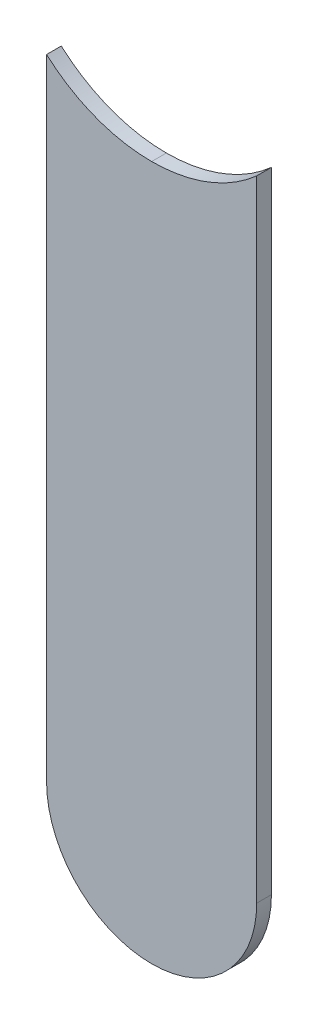
ISO-10303-21;
HEADER;
FILE_DESCRIPTION(('STEP AP214'),'2;1');
FILE_NAME('part.step','',(''),(''),'','','');
FILE_SCHEMA(('AUTOMOTIVE_DESIGN { 1 0 10303 214 1 1 1 1 }'));
ENDSEC;
DATA;
#1=APPLICATION_CONTEXT('core data for automotive mechanical design processes');
#2=APPLICATION_PROTOCOL_DEFINITION('international standard','automotive_design',2000,#1);
#3=PRODUCT_CONTEXT('',#1,'mechanical');
#4=PRODUCT('Part','Part','',(#3));
#5=PRODUCT_RELATED_PRODUCT_CATEGORY('part','',(#4));
#6=PRODUCT_DEFINITION_FORMATION('','',#4);
#7=PRODUCT_DEFINITION_CONTEXT('part definition',#1,'design');
#8=PRODUCT_DEFINITION('design','',#6,#7);
#9=PRODUCT_DEFINITION_SHAPE('','',#8);
#10=(LENGTH_UNIT() NAMED_UNIT(*) SI_UNIT(.MILLI.,.METRE.));
#11=(NAMED_UNIT(*) PLANE_ANGLE_UNIT() SI_UNIT($,.RADIAN.));
#12=(NAMED_UNIT(*) SI_UNIT($,.STERADIAN.) SOLID_ANGLE_UNIT());
#13=UNCERTAINTY_MEASURE_WITH_UNIT(LENGTH_MEASURE(1.E-05),#10,'distance_accuracy_value','');
#14=(GEOMETRIC_REPRESENTATION_CONTEXT(3) GLOBAL_UNCERTAINTY_ASSIGNED_CONTEXT((#13)) GLOBAL_UNIT_ASSIGNED_CONTEXT((#10,
#11,#12)) REPRESENTATION_CONTEXT('',''));
#15=CARTESIAN_POINT('',(0.,0.,0.));
#16=DIRECTION('',(0.,0.,1.));
#17=DIRECTION('',(1.,0.,0.));
#18=AXIS2_PLACEMENT_3D('',#15,#16,#17);
#19=CARTESIAN_POINT('',(142.24,-103.632,-0.045));
#20=DIRECTION('',(0.,0.,-1.));
#21=DIRECTION('',(0.,-1.,0.));
#22=AXIS2_PLACEMENT_3D('',#19,#20,#21);
#23=CYLINDRICAL_SURFACE('',#22,0.375);
#24=DIRECTION('',(0.,0.,1.));
#25=VECTOR('',#24,1.);
#26=CARTESIAN_POINT('',(142.24,-104.007,-0.045));
#27=LINE('',#26,#25);
#28=CARTESIAN_POINT('',(142.24,-104.007,-0.035));
#29=VERTEX_POINT('',#28);
#30=CARTESIAN_POINT('',(142.24,-104.007,0.));
#31=VERTEX_POINT('',#30);
#32=EDGE_CURVE('E50',#29,#31,#27,.T.);
#33=ORIENTED_EDGE('',*,*,#32,.F.);
#34=CARTESIAN_POINT('',(142.24,-103.632,-0.035));
#35=DIRECTION('',(0.,0.,-1.));
#36=DIRECTION('',(0.,-1.,0.));
#37=AXIS2_PLACEMENT_3D('',#34,#35,#36);
#38=CIRCLE('',#37,0.375);
#39=CARTESIAN_POINT('',(141.99,-103.9115084972,-0.035));
#40=VERTEX_POINT('',#39);
#41=EDGE_CURVE('E118',#29,#40,#38,.T.);
#42=ORIENTED_EDGE('',*,*,#41,.T.);
#43=DIRECTION('',(0.,0.,-1.));
#44=VECTOR('',#43,1.);
#45=CARTESIAN_POINT('',(141.99,-103.9115084971,-0.045));
#46=LINE('',#45,#44);
#47=CARTESIAN_POINT('',(141.99,-103.9115084972,0.));
#48=VERTEX_POINT('',#47);
#49=EDGE_CURVE('E11',#48,#40,#46,.T.);
#50=ORIENTED_EDGE('',*,*,#49,.F.);
#51=CARTESIAN_POINT('',(142.24,-103.632,0.));
#52=DIRECTION('',(0.,0.,-1.));
#53=DIRECTION('',(0.,-1.,0.));
#54=AXIS2_PLACEMENT_3D('',#51,#52,#53);
#55=CIRCLE('',#54,0.375);
#56=EDGE_CURVE('E126',#31,#48,#55,.T.);
#57=ORIENTED_EDGE('',*,*,#56,.F.);
#58=EDGE_LOOP('',(#33,#42,#50,#57));
#59=FACE_BOUND('',#58,.T.);
#60=ADVANCED_FACE('F17',(#59),#23,.F.);
#61=CARTESIAN_POINT('',(141.99,-103.632,-0.035));
#62=DIRECTION('',(1.,0.,0.));
#63=DIRECTION('',(0.,1.,0.));
#64=AXIS2_PLACEMENT_3D('',#61,#62,#63);
#65=PLANE('',#64);
#66=DIRECTION('',(0.,0.,1.));
#67=VECTOR('',#66,1.);
#68=CARTESIAN_POINT('',(141.99,-105.41,-0.035));
#69=LINE('',#68,#67);
#70=CARTESIAN_POINT('',(141.99,-105.41,-0.035));
#71=VERTEX_POINT('',#70);
#72=CARTESIAN_POINT('',(141.99,-105.41,0.));
#73=VERTEX_POINT('',#72);
#74=EDGE_CURVE('E20',#71,#73,#69,.T.);
#75=ORIENTED_EDGE('',*,*,#74,.T.);
#76=DIRECTION('',(0.,-1.,0.));
#77=VECTOR('',#76,1.);
#78=CARTESIAN_POINT('',(141.99,-103.632,0.));
#79=LINE('',#78,#77);
#80=EDGE_CURVE('E127',#48,#73,#79,.T.);
#81=ORIENTED_EDGE('',*,*,#80,.F.);
#82=ORIENTED_EDGE('',*,*,#49,.T.);
#83=DIRECTION('',(0.,-1.,0.));
#84=VECTOR('',#83,1.);
#85=CARTESIAN_POINT('',(141.99,-103.632,-0.035));
#86=LINE('',#85,#84);
#87=EDGE_CURVE('E98',#40,#71,#86,.T.);
#88=ORIENTED_EDGE('',*,*,#87,.T.);
#89=EDGE_LOOP('',(#75,#81,#82,#88));
#90=FACE_BOUND('',#89,.T.);
#91=ADVANCED_FACE('F148',(#90),#65,.F.);
#92=CARTESIAN_POINT('',(142.24,-105.41,-0.035));
#93=DIRECTION('',(0.,0.,-1.));
#94=DIRECTION('',(-1.,0.,0.));
#95=AXIS2_PLACEMENT_3D('',#92,#93,#94);
#96=CYLINDRICAL_SURFACE('',#95,0.25);
#97=CARTESIAN_POINT('',(142.24,-105.41,-0.035));
#98=DIRECTION('',(0.,0.,1.));
#99=DIRECTION('',(-1.,0.,0.));
#100=AXIS2_PLACEMENT_3D('',#97,#98,#99);
#101=CIRCLE('',#100,0.25);
#102=CARTESIAN_POINT('',(142.49,-105.41,-0.035));
#103=VERTEX_POINT('',#102);
#104=EDGE_CURVE('E78',#71,#103,#101,.T.);
#105=ORIENTED_EDGE('',*,*,#104,.T.);
#106=DIRECTION('',(0.,0.,1.));
#107=VECTOR('',#106,1.);
#108=CARTESIAN_POINT('',(142.49,-105.41,-0.035));
#109=LINE('',#108,#107);
#110=CARTESIAN_POINT('',(142.49,-105.41,0.));
#111=VERTEX_POINT('',#110);
#112=EDGE_CURVE('E82',#103,#111,#109,.T.);
#113=ORIENTED_EDGE('',*,*,#112,.T.);
#114=CARTESIAN_POINT('',(142.24,-105.41,0.));
#115=DIRECTION('',(0.,0.,1.));
#116=DIRECTION('',(-1.,0.,0.));
#117=AXIS2_PLACEMENT_3D('',#114,#115,#116);
#118=CIRCLE('',#117,0.25);
#119=EDGE_CURVE('E123',#73,#111,#118,.T.);
#120=ORIENTED_EDGE('',*,*,#119,.F.);
#121=ORIENTED_EDGE('',*,*,#74,.F.);
#122=EDGE_LOOP('',(#105,#113,#120,#121));
#123=FACE_BOUND('',#122,.T.);
#124=ADVANCED_FACE('F80',(#123),#96,.T.);
#125=CARTESIAN_POINT('',(142.49,-105.41,0.));
#126=DIRECTION('',(0.,0.,1.));
#127=DIRECTION('',(1.,0.,0.));
#128=AXIS2_PLACEMENT_3D('',#125,#126,#127);
#129=PLANE('',#128);
#130=ORIENTED_EDGE('',*,*,#119,.T.);
#131=DIRECTION('',(0.,1.,0.));
#132=VECTOR('',#131,1.);
#133=CARTESIAN_POINT('',(142.49,-105.41,0.));
#134=LINE('',#133,#132);
#135=CARTESIAN_POINT('',(142.49,-103.9115084971,0.));
#136=VERTEX_POINT('',#135);
#137=EDGE_CURVE('E102',#111,#136,#134,.T.);
#138=ORIENTED_EDGE('',*,*,#137,.T.);
#139=CARTESIAN_POINT('',(142.24,-103.632,0.));
#140=DIRECTION('',(0.,0.,-1.));
#141=DIRECTION('',(0.,-1.,0.));
#142=AXIS2_PLACEMENT_3D('',#139,#140,#141);
#143=CIRCLE('',#142,0.375);
#144=EDGE_CURVE('E114',#136,#31,#143,.T.);
#145=ORIENTED_EDGE('',*,*,#144,.T.);
#146=ORIENTED_EDGE('',*,*,#56,.T.);
#147=ORIENTED_EDGE('',*,*,#80,.T.);
#148=EDGE_LOOP('',(#130,#138,#145,#146,#147));
#149=FACE_BOUND('',#148,.T.);
#150=ADVANCED_FACE('F144',(#149),#129,.T.);
#151=CARTESIAN_POINT('',(142.24,-103.632,-0.045));
#152=DIRECTION('',(0.,0.,-1.));
#153=DIRECTION('',(0.,-1.,0.));
#154=AXIS2_PLACEMENT_3D('',#151,#152,#153);
#155=CYLINDRICAL_SURFACE('',#154,0.375);
#156=CARTESIAN_POINT('',(142.24,-103.632,-0.035));
#157=DIRECTION('',(0.,0.,-1.));
#158=DIRECTION('',(0.,-1.,0.));
#159=AXIS2_PLACEMENT_3D('',#156,#157,#158);
#160=CIRCLE('',#159,0.375);
#161=CARTESIAN_POINT('',(142.49,-103.9115084971,-0.035));
#162=VERTEX_POINT('',#161);
#163=EDGE_CURVE('E88',#162,#29,#160,.T.);
#164=ORIENTED_EDGE('',*,*,#163,.T.);
#165=ORIENTED_EDGE('',*,*,#32,.T.);
#166=ORIENTED_EDGE('',*,*,#144,.F.);
#167=DIRECTION('',(0.,0.,-1.));
#168=VECTOR('',#167,1.);
#169=CARTESIAN_POINT('',(142.49,-103.9115084971,-0.045));
#170=LINE('',#169,#168);
#171=EDGE_CURVE('E109',#136,#162,#170,.T.);
#172=ORIENTED_EDGE('',*,*,#171,.T.);
#173=EDGE_LOOP('',(#164,#165,#166,#172));
#174=FACE_BOUND('',#173,.T.);
#175=ADVANCED_FACE('F146',(#174),#155,.F.);
#176=CARTESIAN_POINT('',(142.49,-105.41,-0.035));
#177=DIRECTION('',(0.,0.,1.));
#178=DIRECTION('',(1.,0.,0.));
#179=AXIS2_PLACEMENT_3D('',#176,#177,#178);
#180=PLANE('',#179);
#181=ORIENTED_EDGE('',*,*,#87,.F.);
#182=ORIENTED_EDGE('',*,*,#41,.F.);
#183=ORIENTED_EDGE('',*,*,#163,.F.);
#184=DIRECTION('',(0.,1.,0.));
#185=VECTOR('',#184,1.);
#186=CARTESIAN_POINT('',(142.49,-105.41,-0.035));
#187=LINE('',#186,#185);
#188=EDGE_CURVE('E91',#103,#162,#187,.T.);
#189=ORIENTED_EDGE('',*,*,#188,.F.);
#190=ORIENTED_EDGE('',*,*,#104,.F.);
#191=EDGE_LOOP('',(#181,#182,#183,#189,#190));
#192=FACE_BOUND('',#191,.T.);
#193=ADVANCED_FACE('F92',(#192),#180,.F.);
#194=CARTESIAN_POINT('',(142.49,-105.41,-0.035));
#195=DIRECTION('',(-1.,0.,0.));
#196=DIRECTION('',(0.,0.,1.));
#197=AXIS2_PLACEMENT_3D('',#194,#195,#196);
#198=PLANE('',#197);
#199=ORIENTED_EDGE('',*,*,#171,.F.);
#200=ORIENTED_EDGE('',*,*,#137,.F.);
#201=ORIENTED_EDGE('',*,*,#112,.F.);
#202=ORIENTED_EDGE('',*,*,#188,.T.);
#203=EDGE_LOOP('',(#199,#200,#201,#202));
#204=FACE_BOUND('',#203,.T.);
#205=ADVANCED_FACE('F100',(#204),#198,.F.);
#206=CLOSED_SHELL('',(#60,#91,#124,#150,#175,#193,#205));
#207=MANIFOLD_SOLID_BREP('B1',#206);
#208=ADVANCED_BREP_SHAPE_REPRESENTATION('',(#18,#207),#14);
#209=SHAPE_DEFINITION_REPRESENTATION(#9,#208);
ENDSEC;
END-ISO-10303-21;
